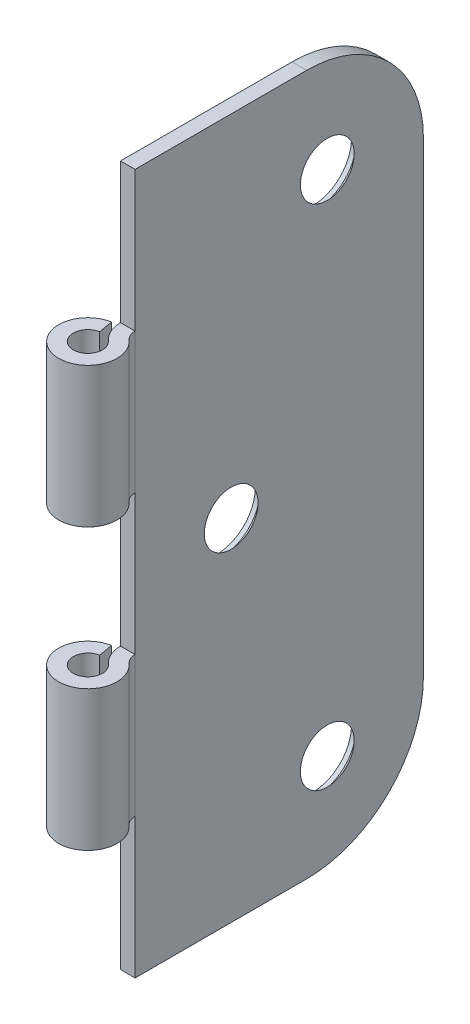
ISO-10303-21;
HEADER;
FILE_DESCRIPTION(('STEP AP214'),'2;1');
FILE_NAME('part.step','',(''),(''),'','','');
FILE_SCHEMA(('AUTOMOTIVE_DESIGN { 1 0 10303 214 1 1 1 1 }'));
ENDSEC;
DATA;
#1=APPLICATION_CONTEXT('core data for automotive mechanical design processes');
#2=APPLICATION_PROTOCOL_DEFINITION('international standard','automotive_design',2000,#1);
#3=PRODUCT_CONTEXT('',#1,'mechanical');
#4=PRODUCT('Part','Part','',(#3));
#5=PRODUCT_RELATED_PRODUCT_CATEGORY('part','',(#4));
#6=PRODUCT_DEFINITION_FORMATION('','',#4);
#7=PRODUCT_DEFINITION_CONTEXT('part definition',#1,'design');
#8=PRODUCT_DEFINITION('design','',#6,#7);
#9=PRODUCT_DEFINITION_SHAPE('','',#8);
#10=(LENGTH_UNIT() NAMED_UNIT(*) SI_UNIT(.MILLI.,.METRE.));
#11=(NAMED_UNIT(*) PLANE_ANGLE_UNIT() SI_UNIT($,.RADIAN.));
#12=(NAMED_UNIT(*) SI_UNIT($,.STERADIAN.) SOLID_ANGLE_UNIT());
#13=UNCERTAINTY_MEASURE_WITH_UNIT(LENGTH_MEASURE(1.E-05),#10,'distance_accuracy_value','');
#14=(GEOMETRIC_REPRESENTATION_CONTEXT(3) GLOBAL_UNCERTAINTY_ASSIGNED_CONTEXT((#13)) GLOBAL_UNIT_ASSIGNED_CONTEXT((#10,
#11,#12)) REPRESENTATION_CONTEXT('',''));
#15=CARTESIAN_POINT('',(0.,0.,0.));
#16=DIRECTION('',(0.,0.,1.));
#17=DIRECTION('',(1.,0.,0.));
#18=AXIS2_PLACEMENT_3D('',#15,#16,#17);
#19=CARTESIAN_POINT('',(0.,38.1,0.));
#20=DIRECTION('',(0.,-1.,0.));
#21=DIRECTION('',(0.,0.,-1.));
#22=AXIS2_PLACEMENT_3D('',#19,#20,#21);
#23=CYLINDRICAL_SURFACE('',#22,3.175);
#24=DIRECTION('',(0.,-1.,0.));
#25=VECTOR('',#24,1.);
#26=CARTESIAN_POINT('',(-0.551332964092483,38.1,-3.12676461581376));
#27=LINE('',#26,#25);
#28=CARTESIAN_POINT('',(-0.551332964092483,22.86,-3.12676461581376));
#29=VERTEX_POINT('',#28);
#30=CARTESIAN_POINT('',(-0.551332964092483,7.62000000000002,-3.12676461581376));
#31=VERTEX_POINT('',#30);
#32=EDGE_CURVE('E209',#29,#31,#27,.T.);
#33=ORIENTED_EDGE('',*,*,#32,.T.);
#34=CARTESIAN_POINT('',(0.,7.62000000000002,0.));
#35=DIRECTION('',(0.,1.,0.));
#36=DIRECTION('',(0.,0.,1.));
#37=AXIS2_PLACEMENT_3D('',#34,#35,#36);
#38=CIRCLE('',#37,3.175);
#39=CARTESIAN_POINT('',(2.11666666666667,7.62000000000002,-2.36650527618728));
#40=VERTEX_POINT('',#39);
#41=EDGE_CURVE('E327',#40,#31,#38,.F.);
#42=ORIENTED_EDGE('',*,*,#41,.F.);
#43=DIRECTION('',(0.,-1.,0.));
#44=VECTOR('',#43,1.);
#45=CARTESIAN_POINT('',(2.11666666666667,38.1,-2.36650527618728));
#46=LINE('',#45,#44);
#47=CARTESIAN_POINT('',(2.11666666666667,22.86,-2.36650527618728));
#48=VERTEX_POINT('',#47);
#49=EDGE_CURVE('E192',#48,#40,#46,.T.);
#50=ORIENTED_EDGE('',*,*,#49,.F.);
#51=CARTESIAN_POINT('',(0.,22.86,0.));
#52=DIRECTION('',(0.,-1.,0.));
#53=DIRECTION('',(0.,0.,-1.));
#54=AXIS2_PLACEMENT_3D('',#51,#52,#53);
#55=CIRCLE('',#54,3.175);
#56=EDGE_CURVE('E296',#29,#48,#55,.F.);
#57=ORIENTED_EDGE('',*,*,#56,.F.);
#58=EDGE_LOOP('',(#33,#42,#50,#57));
#59=FACE_BOUND('',#58,.T.);
#60=ADVANCED_FACE('F37',(#59),#23,.T.);
#61=CARTESIAN_POINT('',(3.175,38.1,-3.54975791428091));
#62=DIRECTION('',(0.,-1.,0.));
#63=DIRECTION('',(0.,0.,-1.));
#64=AXIS2_PLACEMENT_3D('',#61,#62,#63);
#65=CYLINDRICAL_SURFACE('',#64,3.175);
#66=DIRECTION('',(0.,-1.,0.));
#67=VECTOR('',#66,1.);
#68=CARTESIAN_POINT('',(0.,38.1,-3.54975791428091));
#69=LINE('',#68,#67);
#70=CARTESIAN_POINT('',(0.,22.86,-3.5497579142809));
#71=VERTEX_POINT('',#70);
#72=CARTESIAN_POINT('',(0.,7.62000000000003,-3.54975791428091));
#73=VERTEX_POINT('',#72);
#74=EDGE_CURVE('E279',#71,#73,#69,.T.);
#75=ORIENTED_EDGE('',*,*,#74,.T.);
#76=CARTESIAN_POINT('',(3.175,7.62000000000002,-3.54975791428091));
#77=DIRECTION('',(0.,1.,0.));
#78=DIRECTION('',(0.,0.,1.));
#79=AXIS2_PLACEMENT_3D('',#76,#77,#78);
#80=CIRCLE('',#79,3.175);
#81=CARTESIAN_POINT('',(1.05833333333333,7.62000000000002,-1.18325263809364));
#82=VERTEX_POINT('',#81);
#83=EDGE_CURVE('E182',#73,#82,#80,.T.);
#84=ORIENTED_EDGE('',*,*,#83,.T.);
#85=DIRECTION('',(0.,-1.,0.));
#86=VECTOR('',#85,1.);
#87=CARTESIAN_POINT('',(1.05833333333333,38.1,-1.18325263809364));
#88=LINE('',#87,#86);
#89=CARTESIAN_POINT('',(1.05833333333333,22.86,-1.18325263809364));
#90=VERTEX_POINT('',#89);
#91=EDGE_CURVE('E217',#90,#82,#88,.T.);
#92=ORIENTED_EDGE('',*,*,#91,.F.);
#93=CARTESIAN_POINT('',(3.175,22.86,-3.54975791428091));
#94=DIRECTION('',(0.,-1.,0.));
#95=DIRECTION('',(0.,0.,-1.));
#96=AXIS2_PLACEMENT_3D('',#93,#94,#95);
#97=CIRCLE('',#96,3.175);
#98=EDGE_CURVE('E284',#90,#71,#97,.T.);
#99=ORIENTED_EDGE('',*,*,#98,.T.);
#100=EDGE_LOOP('',(#75,#84,#92,#99));
#101=FACE_BOUND('',#100,.T.);
#102=ADVANCED_FACE('F381',(#101),#65,.T.);
#103=CARTESIAN_POINT('',(0.,38.1,0.));
#104=DIRECTION('',(0.,-1.,0.));
#105=DIRECTION('',(0.,0.,-1.));
#106=AXIS2_PLACEMENT_3D('',#103,#104,#105);
#107=CYLINDRICAL_SURFACE('',#106,1.5875);
#108=ORIENTED_EDGE('',*,*,#91,.T.);
#109=CARTESIAN_POINT('',(0.,7.62000000000002,0.));
#110=DIRECTION('',(0.,1.,0.));
#111=DIRECTION('',(0.,0.,1.));
#112=AXIS2_PLACEMENT_3D('',#109,#110,#111);
#113=CIRCLE('',#112,1.5875);
#114=CARTESIAN_POINT('',(-0.275666482046241,7.62000000000002,-1.56338230790688));
#115=VERTEX_POINT('',#114);
#116=EDGE_CURVE('E322',#82,#115,#113,.F.);
#117=ORIENTED_EDGE('',*,*,#116,.T.);
#118=DIRECTION('',(0.,-1.,0.));
#119=VECTOR('',#118,1.);
#120=CARTESIAN_POINT('',(-0.275666482046241,38.1,-1.56338230790688));
#121=LINE('',#120,#119);
#122=CARTESIAN_POINT('',(-0.275666482046241,22.86,-1.56338230790688));
#123=VERTEX_POINT('',#122);
#124=EDGE_CURVE('E213',#123,#115,#121,.T.);
#125=ORIENTED_EDGE('',*,*,#124,.F.);
#126=CARTESIAN_POINT('',(0.,22.86,0.));
#127=DIRECTION('',(0.,-1.,0.));
#128=DIRECTION('',(0.,0.,-1.));
#129=AXIS2_PLACEMENT_3D('',#126,#127,#128);
#130=CIRCLE('',#129,1.5875);
#131=EDGE_CURVE('E290',#123,#90,#130,.F.);
#132=ORIENTED_EDGE('',*,*,#131,.T.);
#133=EDGE_LOOP('',(#108,#117,#125,#132));
#134=FACE_BOUND('',#133,.T.);
#135=ADVANCED_FACE('F388',(#134),#107,.F.);
#136=CARTESIAN_POINT('',(0.,38.1,0.));
#137=DIRECTION('',(0.984807753012209,0.,-0.173648177666924));
#138=DIRECTION('',(-0.173648177666924,0.,-0.984807753012209));
#139=AXIS2_PLACEMENT_3D('',#136,#137,#138);
#140=PLANE('',#139);
#141=DIRECTION('',(0.173648177666924,0.,0.984807753012209));
#142=VECTOR('',#141,1.);
#143=CARTESIAN_POINT('',(0.,7.62000000000002,0.));
#144=LINE('',#143,#142);
#145=EDGE_CURVE('E325',#31,#115,#144,.T.);
#146=ORIENTED_EDGE('',*,*,#145,.F.);
#147=ORIENTED_EDGE('',*,*,#32,.F.);
#148=DIRECTION('',(-0.173648177666924,0.,-0.984807753012209));
#149=VECTOR('',#148,1.);
#150=CARTESIAN_POINT('',(0.,22.86,0.));
#151=LINE('',#150,#149);
#152=EDGE_CURVE('E293',#123,#29,#151,.T.);
#153=ORIENTED_EDGE('',*,*,#152,.F.);
#154=ORIENTED_EDGE('',*,*,#124,.T.);
#155=EDGE_LOOP('',(#146,#147,#153,#154));
#156=FACE_BOUND('',#155,.T.);
#157=ADVANCED_FACE('F402',(#156),#140,.T.);
#158=CARTESIAN_POINT('',(3.175,38.1,-3.54975791428091));
#159=DIRECTION('',(0.,-1.,0.));
#160=DIRECTION('',(0.,0.,-1.));
#161=AXIS2_PLACEMENT_3D('',#158,#159,#160);
#162=CYLINDRICAL_SURFACE('',#161,1.5875);
#163=CARTESIAN_POINT('',(3.175,7.62000000000002,-3.54975791428091));
#164=DIRECTION('',(0.,1.,0.));
#165=DIRECTION('',(0.,0.,1.));
#166=AXIS2_PLACEMENT_3D('',#163,#164,#165);
#167=CIRCLE('',#166,1.5875);
#168=CARTESIAN_POINT('',(1.5875,7.62000000000002,-3.54975791428091));
#169=VERTEX_POINT('',#168);
#170=EDGE_CURVE('E179',#169,#40,#167,.T.);
#171=ORIENTED_EDGE('',*,*,#170,.F.);
#172=DIRECTION('',(0.,-1.,0.));
#173=VECTOR('',#172,1.);
#174=CARTESIAN_POINT('',(1.5875,38.1,-3.54975791428091));
#175=LINE('',#174,#173);
#176=CARTESIAN_POINT('',(1.5875,22.86,-3.5497579142809));
#177=VERTEX_POINT('',#176);
#178=EDGE_CURVE('E189',#177,#169,#175,.T.);
#179=ORIENTED_EDGE('',*,*,#178,.F.);
#180=CARTESIAN_POINT('',(3.175,22.86,-3.54975791428091));
#181=DIRECTION('',(0.,-1.,0.));
#182=DIRECTION('',(0.,0.,-1.));
#183=AXIS2_PLACEMENT_3D('',#180,#181,#182);
#184=CIRCLE('',#183,1.5875);
#185=EDGE_CURVE('E223',#48,#177,#184,.T.);
#186=ORIENTED_EDGE('',*,*,#185,.F.);
#187=ORIENTED_EDGE('',*,*,#49,.T.);
#188=EDGE_LOOP('',(#171,#179,#186,#187));
#189=FACE_BOUND('',#188,.T.);
#190=ADVANCED_FACE('F187',(#189),#162,.F.);
#191=CARTESIAN_POINT('',(0.,-7.61999999999997,0.));
#192=DIRECTION('',(0.,-1.,0.));
#193=DIRECTION('',(0.,0.,-1.));
#194=AXIS2_PLACEMENT_3D('',#191,#192,#193);
#195=CIRCLE('',#194,3.175);
#196=CARTESIAN_POINT('',(-0.551332964092483,-7.61999999999997,-3.12676461581376));
#197=VERTEX_POINT('',#196);
#198=CARTESIAN_POINT('',(2.11666666666667,-7.61999999999997,-2.36650527618728));
#199=VERTEX_POINT('',#198);
#200=EDGE_CURVE('E173',#197,#199,#195,.F.);
#201=ORIENTED_EDGE('',*,*,#200,.F.);
#202=CARTESIAN_POINT('',(-0.551332964092483,-22.86,-3.12676461581376));
#203=VERTEX_POINT('',#202);
#204=EDGE_CURVE('E208',#197,#203,#27,.T.);
#205=ORIENTED_EDGE('',*,*,#204,.T.);
#206=CARTESIAN_POINT('',(0.,-22.86,0.));
#207=DIRECTION('',(0.,1.,0.));
#208=DIRECTION('',(0.,0.,1.));
#209=AXIS2_PLACEMENT_3D('',#206,#207,#208);
#210=CIRCLE('',#209,3.175);
#211=CARTESIAN_POINT('',(2.11666666666667,-22.86,-2.36650527618728));
#212=VERTEX_POINT('',#211);
#213=EDGE_CURVE('E310',#212,#203,#210,.F.);
#214=ORIENTED_EDGE('',*,*,#213,.F.);
#215=EDGE_CURVE('E202',#199,#212,#46,.T.);
#216=ORIENTED_EDGE('',*,*,#215,.F.);
#217=EDGE_LOOP('',(#201,#205,#214,#216));
#218=FACE_BOUND('',#217,.T.);
#219=ADVANCED_FACE('F384',(#218),#23,.T.);
#220=CARTESIAN_POINT('',(1.05833333333333,-7.61999999999997,-1.18325263809364));
#221=VERTEX_POINT('',#220);
#222=CARTESIAN_POINT('',(1.05833333333333,-22.86,-1.18325263809364));
#223=VERTEX_POINT('',#222);
#224=EDGE_CURVE('E216',#221,#223,#88,.T.);
#225=ORIENTED_EDGE('',*,*,#224,.F.);
#226=CARTESIAN_POINT('',(3.175,-7.61999999999997,-3.54975791428091));
#227=DIRECTION('',(0.,-1.,0.));
#228=DIRECTION('',(0.,0.,-1.));
#229=AXIS2_PLACEMENT_3D('',#226,#227,#228);
#230=CIRCLE('',#229,3.175);
#231=CARTESIAN_POINT('',(0.,-7.61999999999997,-3.54975791428091));
#232=VERTEX_POINT('',#231);
#233=EDGE_CURVE('E329',#221,#232,#230,.T.);
#234=ORIENTED_EDGE('',*,*,#233,.T.);
#235=CARTESIAN_POINT('',(0.,-22.86,-3.54975791428091));
#236=VERTEX_POINT('',#235);
#237=EDGE_CURVE('E281',#232,#236,#69,.T.);
#238=ORIENTED_EDGE('',*,*,#237,.T.);
#239=CARTESIAN_POINT('',(3.175,-22.86,-3.54975791428091));
#240=DIRECTION('',(0.,1.,0.));
#241=DIRECTION('',(0.,0.,1.));
#242=AXIS2_PLACEMENT_3D('',#239,#240,#241);
#243=CIRCLE('',#242,3.175);
#244=EDGE_CURVE('E301',#236,#223,#243,.T.);
#245=ORIENTED_EDGE('',*,*,#244,.T.);
#246=EDGE_LOOP('',(#225,#234,#238,#245));
#247=FACE_BOUND('',#246,.T.);
#248=ADVANCED_FACE('F391',(#247),#65,.T.);
#249=CARTESIAN_POINT('',(-0.275666482046241,-7.61999999999997,-1.56338230790688));
#250=VERTEX_POINT('',#249);
#251=CARTESIAN_POINT('',(-0.275666482046241,-22.86,-1.56338230790688));
#252=VERTEX_POINT('',#251);
#253=EDGE_CURVE('E212',#250,#252,#121,.T.);
#254=ORIENTED_EDGE('',*,*,#253,.F.);
#255=CARTESIAN_POINT('',(0.,-7.61999999999997,0.));
#256=DIRECTION('',(0.,-1.,0.));
#257=DIRECTION('',(0.,0.,-1.));
#258=AXIS2_PLACEMENT_3D('',#255,#256,#257);
#259=CIRCLE('',#258,1.5875);
#260=EDGE_CURVE('E332',#250,#221,#259,.F.);
#261=ORIENTED_EDGE('',*,*,#260,.T.);
#262=ORIENTED_EDGE('',*,*,#224,.T.);
#263=CARTESIAN_POINT('',(0.,-22.86,0.));
#264=DIRECTION('',(0.,1.,0.));
#265=DIRECTION('',(0.,0.,1.));
#266=AXIS2_PLACEMENT_3D('',#263,#264,#265);
#267=CIRCLE('',#266,1.5875);
#268=EDGE_CURVE('E304',#223,#252,#267,.F.);
#269=ORIENTED_EDGE('',*,*,#268,.T.);
#270=EDGE_LOOP('',(#254,#261,#262,#269));
#271=FACE_BOUND('',#270,.T.);
#272=ADVANCED_FACE('F400',(#271),#107,.F.);
#273=DIRECTION('',(-0.173648177666924,0.,-0.984807753012209));
#274=VECTOR('',#273,1.);
#275=CARTESIAN_POINT('',(0.,-7.61999999999997,0.));
#276=LINE('',#275,#274);
#277=EDGE_CURVE('E335',#250,#197,#276,.T.);
#278=ORIENTED_EDGE('',*,*,#277,.F.);
#279=ORIENTED_EDGE('',*,*,#253,.T.);
#280=DIRECTION('',(0.173648177666924,0.,0.984807753012209));
#281=VECTOR('',#280,1.);
#282=CARTESIAN_POINT('',(0.,-22.86,0.));
#283=LINE('',#282,#281);
#284=EDGE_CURVE('E307',#203,#252,#283,.T.);
#285=ORIENTED_EDGE('',*,*,#284,.F.);
#286=ORIENTED_EDGE('',*,*,#204,.F.);
#287=EDGE_LOOP('',(#278,#279,#285,#286));
#288=FACE_BOUND('',#287,.T.);
#289=ADVANCED_FACE('F414',(#288),#140,.T.);
#290=CARTESIAN_POINT('',(3.175,-7.61999999999997,-3.54975791428091));
#291=DIRECTION('',(0.,-1.,0.));
#292=DIRECTION('',(0.,0.,-1.));
#293=AXIS2_PLACEMENT_3D('',#290,#291,#292);
#294=CIRCLE('',#293,1.5875);
#295=CARTESIAN_POINT('',(1.5875,-7.61999999999997,-3.54975791428091));
#296=VERTEX_POINT('',#295);
#297=EDGE_CURVE('E194',#199,#296,#294,.T.);
#298=ORIENTED_EDGE('',*,*,#297,.F.);
#299=ORIENTED_EDGE('',*,*,#215,.T.);
#300=CARTESIAN_POINT('',(3.175,-22.86,-3.54975791428091));
#301=DIRECTION('',(0.,1.,0.));
#302=DIRECTION('',(0.,0.,1.));
#303=AXIS2_PLACEMENT_3D('',#300,#301,#302);
#304=CIRCLE('',#303,1.5875);
#305=CARTESIAN_POINT('',(1.5875,-22.86,-3.54975791428091));
#306=VERTEX_POINT('',#305);
#307=EDGE_CURVE('E228',#306,#212,#304,.T.);
#308=ORIENTED_EDGE('',*,*,#307,.F.);
#309=EDGE_CURVE('E200',#296,#306,#175,.T.);
#310=ORIENTED_EDGE('',*,*,#309,.F.);
#311=EDGE_LOOP('',(#298,#299,#308,#310));
#312=FACE_BOUND('',#311,.T.);
#313=ADVANCED_FACE('F403',(#312),#162,.F.);
#314=CARTESIAN_POINT('',(1.5875,38.1,0.));
#315=DIRECTION('',(1.,0.,0.));
#316=DIRECTION('',(0.,0.,-1.));
#317=AXIS2_PLACEMENT_3D('',#314,#315,#316);
#318=PLANE('',#317);
#319=CARTESIAN_POINT('',(1.5875,-27.641585971427,-24.466585971427));
#320=DIRECTION('',(1.,0.,0.));
#321=DIRECTION('',(0.,0.,-1.));
#322=AXIS2_PLACEMENT_3D('',#319,#320,#321);
#323=CIRCLE('',#322,2.92990199679455);
#324=CARTESIAN_POINT('',(1.5875,-27.641585971427,-27.3964879682215));
#325=VERTEX_POINT('',#324);
#326=EDGE_CURVE('E241',#325,#325,#323,.T.);
#327=ORIENTED_EDGE('',*,*,#326,.F.);
#328=EDGE_LOOP('',(#327));
#329=FACE_BOUND('',#328,.T.);
#330=CARTESIAN_POINT('',(1.5875,0.,-14.0081719428539));
#331=DIRECTION('',(1.,0.,0.));
#332=DIRECTION('',(0.,0.,-1.));
#333=AXIS2_PLACEMENT_3D('',#330,#331,#332);
#334=CIRCLE('',#333,2.92990199679455);
#335=CARTESIAN_POINT('',(1.5875,0.,-16.9380739396485));
#336=VERTEX_POINT('',#335);
#337=EDGE_CURVE('E236',#336,#336,#334,.T.);
#338=ORIENTED_EDGE('',*,*,#337,.F.);
#339=EDGE_LOOP('',(#338));
#340=FACE_BOUND('',#339,.T.);
#341=CARTESIAN_POINT('',(1.5875,27.641585971427,-24.466585971427));
#342=DIRECTION('',(1.,0.,0.));
#343=DIRECTION('',(0.,0.,-1.));
#344=AXIS2_PLACEMENT_3D('',#341,#342,#343);
#345=CIRCLE('',#344,2.92990199679455);
#346=CARTESIAN_POINT('',(1.5875,27.641585971427,-27.3964879682215));
#347=VERTEX_POINT('',#346);
#348=EDGE_CURVE('E232',#347,#347,#345,.T.);
#349=ORIENTED_EDGE('',*,*,#348,.F.);
#350=EDGE_LOOP('',(#349));
#351=FACE_BOUND('',#350,.T.);
#352=DIRECTION('',(0.,0.,1.));
#353=VECTOR('',#352,1.);
#354=CARTESIAN_POINT('',(1.5875,-38.1,0.));
#355=LINE('',#354,#353);
#356=CARTESIAN_POINT('',(1.5875,-38.1,-22.225));
#357=VERTEX_POINT('',#356);
#358=CARTESIAN_POINT('',(1.5875,-38.1,-3.54975791428091));
#359=VERTEX_POINT('',#358);
#360=EDGE_CURVE('E271',#357,#359,#355,.T.);
#361=ORIENTED_EDGE('',*,*,#360,.F.);
#362=CARTESIAN_POINT('',(1.5875,-25.4,-22.225));
#363=DIRECTION('',(1.,0.,0.));
#364=DIRECTION('',(0.,0.,-1.));
#365=AXIS2_PLACEMENT_3D('',#362,#363,#364);
#366=CIRCLE('',#365,12.7);
#367=CARTESIAN_POINT('',(1.5875,-25.4,-34.925));
#368=VERTEX_POINT('',#367);
#369=EDGE_CURVE('E250',#357,#368,#366,.T.);
#370=ORIENTED_EDGE('',*,*,#369,.T.);
#371=DIRECTION('',(0.,-1.,0.));
#372=VECTOR('',#371,1.);
#373=CARTESIAN_POINT('',(1.5875,38.1,-34.925));
#374=LINE('',#373,#372);
#375=CARTESIAN_POINT('',(1.5875,25.4,-34.925));
#376=VERTEX_POINT('',#375);
#377=EDGE_CURVE('E203',#376,#368,#374,.T.);
#378=ORIENTED_EDGE('',*,*,#377,.F.);
#379=CARTESIAN_POINT('',(1.5875,25.4,-22.225));
#380=DIRECTION('',(1.,0.,0.));
#381=DIRECTION('',(0.,0.,-1.));
#382=AXIS2_PLACEMENT_3D('',#379,#380,#381);
#383=CIRCLE('',#382,12.7);
#384=CARTESIAN_POINT('',(1.5875,38.1,-22.225));
#385=VERTEX_POINT('',#384);
#386=EDGE_CURVE('E248',#376,#385,#383,.T.);
#387=ORIENTED_EDGE('',*,*,#386,.T.);
#388=DIRECTION('',(0.,0.,1.));
#389=VECTOR('',#388,1.);
#390=CARTESIAN_POINT('',(1.5875,38.1,0.));
#391=LINE('',#390,#389);
#392=CARTESIAN_POINT('',(1.5875,38.1,-3.54975791428091));
#393=VERTEX_POINT('',#392);
#394=EDGE_CURVE('E270',#385,#393,#391,.T.);
#395=ORIENTED_EDGE('',*,*,#394,.T.);
#396=EDGE_CURVE('E199',#393,#177,#175,.T.);
#397=ORIENTED_EDGE('',*,*,#396,.T.);
#398=ORIENTED_EDGE('',*,*,#178,.T.);
#399=DIRECTION('',(0.,1.,0.));
#400=VECTOR('',#399,1.);
#401=CARTESIAN_POINT('',(1.5875,38.1,-3.5497579142809));
#402=LINE('',#401,#400);
#403=EDGE_CURVE('E163',#296,#169,#402,.T.);
#404=ORIENTED_EDGE('',*,*,#403,.F.);
#405=ORIENTED_EDGE('',*,*,#309,.T.);
#406=DIRECTION('',(0.,1.,0.));
#407=VECTOR('',#406,1.);
#408=CARTESIAN_POINT('',(1.5875,38.1,-3.5497579142809));
#409=LINE('',#408,#407);
#410=EDGE_CURVE('E313',#359,#306,#409,.T.);
#411=ORIENTED_EDGE('',*,*,#410,.F.);
#412=EDGE_LOOP('',(#361,#370,#378,#387,#395,#397,#398,#404,#405,#411));
#413=FACE_BOUND('',#412,.T.);
#414=ADVANCED_FACE('F197',(#329,#340,#351,#413),#318,.T.);
#415=CARTESIAN_POINT('',(0.,38.1,-34.925));
#416=DIRECTION('',(0.,0.,-1.));
#417=DIRECTION('',(-1.,0.,0.));
#418=AXIS2_PLACEMENT_3D('',#415,#416,#417);
#419=PLANE('',#418);
#420=ORIENTED_EDGE('',*,*,#377,.T.);
#421=DIRECTION('',(1.,0.,0.));
#422=VECTOR('',#421,1.);
#423=CARTESIAN_POINT('',(0.,-25.4,-34.925));
#424=LINE('',#423,#422);
#425=CARTESIAN_POINT('',(0.,-25.4,-34.925));
#426=VERTEX_POINT('',#425);
#427=EDGE_CURVE('E58',#368,#426,#424,.F.);
#428=ORIENTED_EDGE('',*,*,#427,.T.);
#429=DIRECTION('',(0.,-1.,0.));
#430=VECTOR('',#429,1.);
#431=CARTESIAN_POINT('',(0.,38.1,-34.925));
#432=LINE('',#431,#430);
#433=CARTESIAN_POINT('',(0.,25.4,-34.925));
#434=VERTEX_POINT('',#433);
#435=EDGE_CURVE('E264',#434,#426,#432,.T.);
#436=ORIENTED_EDGE('',*,*,#435,.F.);
#437=DIRECTION('',(1.,0.,0.));
#438=VECTOR('',#437,1.);
#439=CARTESIAN_POINT('',(0.,25.4,-34.925));
#440=LINE('',#439,#438);
#441=EDGE_CURVE('E252',#434,#376,#440,.T.);
#442=ORIENTED_EDGE('',*,*,#441,.T.);
#443=EDGE_LOOP('',(#420,#428,#436,#442));
#444=FACE_BOUND('',#443,.T.);
#445=ADVANCED_FACE('F276',(#444),#419,.T.);
#446=CARTESIAN_POINT('',(0.,38.1,0.));
#447=DIRECTION('',(1.,0.,0.));
#448=DIRECTION('',(0.,0.,-1.));
#449=AXIS2_PLACEMENT_3D('',#446,#447,#448);
#450=PLANE('',#449);
#451=CARTESIAN_POINT('',(0.,-27.641585971427,-24.466585971427));
#452=DIRECTION('',(-1.,0.,0.));
#453=DIRECTION('',(0.,0.,1.));
#454=AXIS2_PLACEMENT_3D('',#451,#452,#453);
#455=CIRCLE('',#454,4.2164);
#456=CARTESIAN_POINT('',(0.,-27.641585971427,-20.250185971427));
#457=VERTEX_POINT('',#456);
#458=EDGE_CURVE('E350',#457,#457,#455,.T.);
#459=ORIENTED_EDGE('',*,*,#458,.F.);
#460=EDGE_LOOP('',(#459));
#461=FACE_BOUND('',#460,.T.);
#462=CARTESIAN_POINT('',(0.,0.,-14.0081719428539));
#463=DIRECTION('',(-1.,0.,0.));
#464=DIRECTION('',(0.,0.,1.));
#465=AXIS2_PLACEMENT_3D('',#462,#463,#464);
#466=CIRCLE('',#465,4.2164);
#467=CARTESIAN_POINT('',(0.,0.,-9.79177194285394));
#468=VERTEX_POINT('',#467);
#469=EDGE_CURVE('E244',#468,#468,#466,.T.);
#470=ORIENTED_EDGE('',*,*,#469,.F.);
#471=EDGE_LOOP('',(#470));
#472=FACE_BOUND('',#471,.T.);
#473=CARTESIAN_POINT('',(0.,27.641585971427,-24.466585971427));
#474=DIRECTION('',(-1.,0.,0.));
#475=DIRECTION('',(0.,0.,1.));
#476=AXIS2_PLACEMENT_3D('',#473,#474,#475);
#477=CIRCLE('',#476,4.2164);
#478=CARTESIAN_POINT('',(0.,27.641585971427,-20.250185971427));
#479=VERTEX_POINT('',#478);
#480=EDGE_CURVE('E239',#479,#479,#477,.T.);
#481=ORIENTED_EDGE('',*,*,#480,.F.);
#482=EDGE_LOOP('',(#481));
#483=FACE_BOUND('',#482,.T.);
#484=ORIENTED_EDGE('',*,*,#435,.T.);
#485=CARTESIAN_POINT('',(0.,-25.4,-22.225));
#486=DIRECTION('',(1.,0.,0.));
#487=DIRECTION('',(0.,0.,-1.));
#488=AXIS2_PLACEMENT_3D('',#485,#486,#487);
#489=CIRCLE('',#488,12.7);
#490=CARTESIAN_POINT('',(0.,-38.1,-22.225));
#491=VERTEX_POINT('',#490);
#492=EDGE_CURVE('E45',#426,#491,#489,.F.);
#493=ORIENTED_EDGE('',*,*,#492,.T.);
#494=DIRECTION('',(0.,0.,1.));
#495=VECTOR('',#494,1.);
#496=CARTESIAN_POINT('',(0.,-38.1,0.));
#497=LINE('',#496,#495);
#498=CARTESIAN_POINT('',(0.,-38.1,-3.54975791428091));
#499=VERTEX_POINT('',#498);
#500=EDGE_CURVE('E262',#491,#499,#497,.T.);
#501=ORIENTED_EDGE('',*,*,#500,.T.);
#502=DIRECTION('',(0.,1.,0.));
#503=VECTOR('',#502,1.);
#504=CARTESIAN_POINT('',(0.,38.1,-3.5497579142809));
#505=LINE('',#504,#503);
#506=EDGE_CURVE('E316',#499,#236,#505,.T.);
#507=ORIENTED_EDGE('',*,*,#506,.T.);
#508=ORIENTED_EDGE('',*,*,#237,.F.);
#509=EDGE_CURVE('E427',#73,#232,#69,.T.);
#510=ORIENTED_EDGE('',*,*,#509,.F.);
#511=ORIENTED_EDGE('',*,*,#74,.F.);
#512=CARTESIAN_POINT('',(0.,38.1,-3.54975791428091));
#513=VERTEX_POINT('',#512);
#514=EDGE_CURVE('E278',#513,#71,#69,.T.);
#515=ORIENTED_EDGE('',*,*,#514,.F.);
#516=DIRECTION('',(0.,0.,1.));
#517=VECTOR('',#516,1.);
#518=CARTESIAN_POINT('',(0.,38.1,0.));
#519=LINE('',#518,#517);
#520=CARTESIAN_POINT('',(0.,38.1,-22.225));
#521=VERTEX_POINT('',#520);
#522=EDGE_CURVE('E285',#521,#513,#519,.T.);
#523=ORIENTED_EDGE('',*,*,#522,.F.);
#524=CARTESIAN_POINT('',(0.,25.4,-22.225));
#525=DIRECTION('',(1.,0.,0.));
#526=DIRECTION('',(0.,0.,-1.));
#527=AXIS2_PLACEMENT_3D('',#524,#525,#526);
#528=CIRCLE('',#527,12.7);
#529=EDGE_CURVE('E256',#521,#434,#528,.F.);
#530=ORIENTED_EDGE('',*,*,#529,.T.);
#531=EDGE_LOOP('',(#484,#493,#501,#507,#508,#510,#511,#515,#523,#530));
#532=FACE_BOUND('',#531,.T.);
#533=ADVANCED_FACE('F260',(#461,#472,#483,#532),#450,.F.);
#534=CARTESIAN_POINT('',(0.,38.1,0.));
#535=DIRECTION('',(0.,1.,0.));
#536=DIRECTION('',(0.,0.,1.));
#537=AXIS2_PLACEMENT_3D('',#534,#535,#536);
#538=PLANE('',#537);
#539=ORIENTED_EDGE('',*,*,#394,.F.);
#540=DIRECTION('',(1.,0.,0.));
#541=VECTOR('',#540,1.);
#542=CARTESIAN_POINT('',(0.,38.1,-22.225));
#543=LINE('',#542,#541);
#544=EDGE_CURVE('E11',#385,#521,#543,.F.);
#545=ORIENTED_EDGE('',*,*,#544,.T.);
#546=ORIENTED_EDGE('',*,*,#522,.T.);
#547=DIRECTION('',(-1.,0.,0.));
#548=VECTOR('',#547,1.);
#549=CARTESIAN_POINT('',(0.,38.1,-3.54975791428091));
#550=LINE('',#549,#548);
#551=EDGE_CURVE('E220',#393,#513,#550,.T.);
#552=ORIENTED_EDGE('',*,*,#551,.F.);
#553=EDGE_LOOP('',(#539,#545,#546,#552));
#554=FACE_BOUND('',#553,.T.);
#555=ADVANCED_FACE('F358',(#554),#538,.T.);
#556=CARTESIAN_POINT('',(0.,-38.1,0.));
#557=DIRECTION('',(0.,1.,0.));
#558=DIRECTION('',(0.,0.,1.));
#559=AXIS2_PLACEMENT_3D('',#556,#557,#558);
#560=PLANE('',#559);
#561=ORIENTED_EDGE('',*,*,#500,.F.);
#562=DIRECTION('',(1.,0.,0.));
#563=VECTOR('',#562,1.);
#564=CARTESIAN_POINT('',(1.5875,-38.1,-22.225));
#565=LINE('',#564,#563);
#566=EDGE_CURVE('E193',#491,#357,#565,.T.);
#567=ORIENTED_EDGE('',*,*,#566,.T.);
#568=ORIENTED_EDGE('',*,*,#360,.T.);
#569=DIRECTION('',(-1.,0.,0.));
#570=VECTOR('',#569,1.);
#571=CARTESIAN_POINT('',(0.,-38.1,-3.54975791428091));
#572=LINE('',#571,#570);
#573=EDGE_CURVE('E225',#359,#499,#572,.T.);
#574=ORIENTED_EDGE('',*,*,#573,.T.);
#575=EDGE_LOOP('',(#561,#567,#568,#574));
#576=FACE_BOUND('',#575,.T.);
#577=ADVANCED_FACE('F268',(#576),#560,.F.);
#578=CARTESIAN_POINT('',(-3.175,22.86,-3.5497579142809));
#579=DIRECTION('',(0.,-1.,0.));
#580=DIRECTION('',(0.,0.,-1.));
#581=AXIS2_PLACEMENT_3D('',#578,#579,#580);
#582=PLANE('',#581);
#583=ORIENTED_EDGE('',*,*,#131,.F.);
#584=ORIENTED_EDGE('',*,*,#152,.T.);
#585=ORIENTED_EDGE('',*,*,#56,.T.);
#586=ORIENTED_EDGE('',*,*,#185,.T.);
#587=DIRECTION('',(1.,0.,0.));
#588=VECTOR('',#587,1.);
#589=CARTESIAN_POINT('',(-3.175,22.86,-3.5497579142809));
#590=LINE('',#589,#588);
#591=EDGE_CURVE('E298',#71,#177,#590,.T.);
#592=ORIENTED_EDGE('',*,*,#591,.F.);
#593=ORIENTED_EDGE('',*,*,#98,.F.);
#594=EDGE_LOOP('',(#583,#584,#585,#586,#592,#593));
#595=FACE_BOUND('',#594,.T.);
#596=ADVANCED_FACE('F437',(#595),#582,.F.);
#597=CARTESIAN_POINT('',(-3.175,38.1,-3.54975791428091));
#598=DIRECTION('',(0.,0.,-1.));
#599=DIRECTION('',(0.,1.,0.));
#600=AXIS2_PLACEMENT_3D('',#597,#598,#599);
#601=PLANE('',#600);
#602=ORIENTED_EDGE('',*,*,#396,.F.);
#603=ORIENTED_EDGE('',*,*,#551,.T.);
#604=ORIENTED_EDGE('',*,*,#514,.T.);
#605=ORIENTED_EDGE('',*,*,#591,.T.);
#606=EDGE_LOOP('',(#602,#603,#604,#605));
#607=FACE_BOUND('',#606,.T.);
#608=ADVANCED_FACE('F434',(#607),#601,.F.);
#609=CARTESIAN_POINT('',(-3.175,-22.86,-3.54975791428091));
#610=DIRECTION('',(0.,1.,0.));
#611=DIRECTION('',(0.,0.,1.));
#612=AXIS2_PLACEMENT_3D('',#609,#610,#611);
#613=PLANE('',#612);
#614=DIRECTION('',(1.,0.,0.));
#615=VECTOR('',#614,1.);
#616=CARTESIAN_POINT('',(-3.175,-22.86,-3.54975791428091));
#617=LINE('',#616,#615);
#618=EDGE_CURVE('E318',#236,#306,#617,.T.);
#619=ORIENTED_EDGE('',*,*,#618,.T.);
#620=ORIENTED_EDGE('',*,*,#307,.T.);
#621=ORIENTED_EDGE('',*,*,#213,.T.);
#622=ORIENTED_EDGE('',*,*,#284,.T.);
#623=ORIENTED_EDGE('',*,*,#268,.F.);
#624=ORIENTED_EDGE('',*,*,#244,.F.);
#625=EDGE_LOOP('',(#619,#620,#621,#622,#623,#624));
#626=FACE_BOUND('',#625,.T.);
#627=ADVANCED_FACE('F417',(#626),#613,.F.);
#628=CARTESIAN_POINT('',(-3.175,-22.86,-3.54975791428091));
#629=DIRECTION('',(0.,0.,-1.));
#630=DIRECTION('',(0.,1.,0.));
#631=AXIS2_PLACEMENT_3D('',#628,#629,#630);
#632=PLANE('',#631);
#633=ORIENTED_EDGE('',*,*,#410,.T.);
#634=ORIENTED_EDGE('',*,*,#618,.F.);
#635=ORIENTED_EDGE('',*,*,#506,.F.);
#636=ORIENTED_EDGE('',*,*,#573,.F.);
#637=EDGE_LOOP('',(#633,#634,#635,#636));
#638=FACE_BOUND('',#637,.T.);
#639=ADVANCED_FACE('F425',(#638),#632,.F.);
#640=CARTESIAN_POINT('',(-3.175,7.62000000000002,-3.54975791428091));
#641=DIRECTION('',(0.,1.,0.));
#642=DIRECTION('',(0.,0.,1.));
#643=AXIS2_PLACEMENT_3D('',#640,#641,#642);
#644=PLANE('',#643);
#645=DIRECTION('',(1.,0.,0.));
#646=VECTOR('',#645,1.);
#647=CARTESIAN_POINT('',(-3.175,7.62000000000002,-3.54975791428091));
#648=LINE('',#647,#646);
#649=EDGE_CURVE('E166',#73,#169,#648,.T.);
#650=ORIENTED_EDGE('',*,*,#649,.T.);
#651=ORIENTED_EDGE('',*,*,#170,.T.);
#652=ORIENTED_EDGE('',*,*,#41,.T.);
#653=ORIENTED_EDGE('',*,*,#145,.T.);
#654=ORIENTED_EDGE('',*,*,#116,.F.);
#655=ORIENTED_EDGE('',*,*,#83,.F.);
#656=EDGE_LOOP('',(#650,#651,#652,#653,#654,#655));
#657=FACE_BOUND('',#656,.T.);
#658=ADVANCED_FACE('F178',(#657),#644,.F.);
#659=CARTESIAN_POINT('',(-3.175,-7.61999999999997,-3.54975791428091));
#660=DIRECTION('',(0.,-1.,0.));
#661=DIRECTION('',(0.,0.,-1.));
#662=AXIS2_PLACEMENT_3D('',#659,#660,#661);
#663=PLANE('',#662);
#664=ORIENTED_EDGE('',*,*,#260,.F.);
#665=ORIENTED_EDGE('',*,*,#277,.T.);
#666=ORIENTED_EDGE('',*,*,#200,.T.);
#667=ORIENTED_EDGE('',*,*,#297,.T.);
#668=DIRECTION('',(1.,0.,0.));
#669=VECTOR('',#668,1.);
#670=CARTESIAN_POINT('',(-3.175,-7.61999999999997,-3.54975791428091));
#671=LINE('',#670,#669);
#672=EDGE_CURVE('E169',#232,#296,#671,.T.);
#673=ORIENTED_EDGE('',*,*,#672,.F.);
#674=ORIENTED_EDGE('',*,*,#233,.F.);
#675=EDGE_LOOP('',(#664,#665,#666,#667,#673,#674));
#676=FACE_BOUND('',#675,.T.);
#677=ADVANCED_FACE('F410',(#676),#663,.F.);
#678=CARTESIAN_POINT('',(-3.175,7.62000000000002,-3.54975791428091));
#679=DIRECTION('',(0.,0.,-1.));
#680=DIRECTION('',(0.,1.,0.));
#681=AXIS2_PLACEMENT_3D('',#678,#679,#680);
#682=PLANE('',#681);
#683=ORIENTED_EDGE('',*,*,#403,.T.);
#684=ORIENTED_EDGE('',*,*,#649,.F.);
#685=ORIENTED_EDGE('',*,*,#509,.T.);
#686=ORIENTED_EDGE('',*,*,#672,.T.);
#687=EDGE_LOOP('',(#683,#684,#685,#686));
#688=FACE_BOUND('',#687,.T.);
#689=ADVANCED_FACE('F165',(#688),#682,.F.);
#690=CARTESIAN_POINT('',(0.507999999999998,27.641585971427,-24.466585971427));
#691=DIRECTION('',(-1.,0.,0.));
#692=DIRECTION('',(0.,0.,1.));
#693=AXIS2_PLACEMENT_3D('',#690,#691,#692);
#694=CONICAL_SURFACE('',#693,4.2164,0.872664625997165);
#695=ORIENTED_EDGE('',*,*,#348,.T.);
#696=EDGE_LOOP('',(#695));
#697=FACE_BOUND('',#696,.T.);
#698=CARTESIAN_POINT('',(0.507999999999998,27.641585971427,-24.466585971427));
#699=DIRECTION('',(-1.,0.,0.));
#700=DIRECTION('',(0.,0.,1.));
#701=AXIS2_PLACEMENT_3D('',#698,#699,#700);
#702=CIRCLE('',#701,4.2164);
#703=CARTESIAN_POINT('',(0.507999999999999,27.641585971427,-20.250185971427));
#704=VERTEX_POINT('',#703);
#705=EDGE_CURVE('E235',#704,#704,#702,.T.);
#706=ORIENTED_EDGE('',*,*,#705,.T.);
#707=EDGE_LOOP('',(#706));
#708=FACE_BOUND('',#707,.T.);
#709=ADVANCED_FACE('F367',(#697,#708),#694,.F.);
#710=CARTESIAN_POINT('',(0.,27.641585971427,-24.466585971427));
#711=DIRECTION('',(-1.,0.,0.));
#712=DIRECTION('',(0.,0.,1.));
#713=AXIS2_PLACEMENT_3D('',#710,#711,#712);
#714=CYLINDRICAL_SURFACE('',#713,4.2164);
#715=ORIENTED_EDGE('',*,*,#705,.F.);
#716=EDGE_LOOP('',(#715));
#717=FACE_BOUND('',#716,.T.);
#718=ORIENTED_EDGE('',*,*,#480,.T.);
#719=EDGE_LOOP('',(#718));
#720=FACE_BOUND('',#719,.T.);
#721=ADVANCED_FACE('F364',(#717,#720),#714,.F.);
#722=CARTESIAN_POINT('',(0.507999999999999,0.,-14.0081719428539));
#723=DIRECTION('',(-1.,0.,0.));
#724=DIRECTION('',(0.,0.,1.));
#725=AXIS2_PLACEMENT_3D('',#722,#723,#724);
#726=CONICAL_SURFACE('',#725,4.2164,0.872664625997165);
#727=ORIENTED_EDGE('',*,*,#337,.T.);
#728=EDGE_LOOP('',(#727));
#729=FACE_BOUND('',#728,.T.);
#730=CARTESIAN_POINT('',(0.507999999999999,0.,-14.0081719428539));
#731=DIRECTION('',(-1.,0.,0.));
#732=DIRECTION('',(0.,0.,1.));
#733=AXIS2_PLACEMENT_3D('',#730,#731,#732);
#734=CIRCLE('',#733,4.2164);
#735=CARTESIAN_POINT('',(0.507999999999999,0.,-9.79177194285394));
#736=VERTEX_POINT('',#735);
#737=EDGE_CURVE('E240',#736,#736,#734,.T.);
#738=ORIENTED_EDGE('',*,*,#737,.T.);
#739=EDGE_LOOP('',(#738));
#740=FACE_BOUND('',#739,.T.);
#741=ADVANCED_FACE('F366',(#729,#740),#726,.F.);
#742=CARTESIAN_POINT('',(0.,0.,-14.0081719428539));
#743=DIRECTION('',(-1.,0.,0.));
#744=DIRECTION('',(0.,0.,1.));
#745=AXIS2_PLACEMENT_3D('',#742,#743,#744);
#746=CYLINDRICAL_SURFACE('',#745,4.2164);
#747=ORIENTED_EDGE('',*,*,#737,.F.);
#748=EDGE_LOOP('',(#747));
#749=FACE_BOUND('',#748,.T.);
#750=ORIENTED_EDGE('',*,*,#469,.T.);
#751=EDGE_LOOP('',(#750));
#752=FACE_BOUND('',#751,.T.);
#753=ADVANCED_FACE('F374',(#749,#752),#746,.F.);
#754=CARTESIAN_POINT('',(0.507999999999998,-27.641585971427,-24.466585971427));
#755=DIRECTION('',(-1.,0.,0.));
#756=DIRECTION('',(0.,0.,1.));
#757=AXIS2_PLACEMENT_3D('',#754,#755,#756);
#758=CONICAL_SURFACE('',#757,4.2164,0.872664625997165);
#759=ORIENTED_EDGE('',*,*,#326,.T.);
#760=EDGE_LOOP('',(#759));
#761=FACE_BOUND('',#760,.T.);
#762=CARTESIAN_POINT('',(0.507999999999998,-27.641585971427,-24.466585971427));
#763=DIRECTION('',(-1.,0.,0.));
#764=DIRECTION('',(0.,0.,1.));
#765=AXIS2_PLACEMENT_3D('',#762,#763,#764);
#766=CIRCLE('',#765,4.2164);
#767=CARTESIAN_POINT('',(0.507999999999999,-27.641585971427,-20.250185971427));
#768=VERTEX_POINT('',#767);
#769=EDGE_CURVE('E245',#768,#768,#766,.T.);
#770=ORIENTED_EDGE('',*,*,#769,.T.);
#771=EDGE_LOOP('',(#770));
#772=FACE_BOUND('',#771,.T.);
#773=ADVANCED_FACE('F518',(#761,#772),#758,.F.);
#774=CARTESIAN_POINT('',(0.,-27.641585971427,-24.466585971427));
#775=DIRECTION('',(-1.,0.,0.));
#776=DIRECTION('',(0.,0.,1.));
#777=AXIS2_PLACEMENT_3D('',#774,#775,#776);
#778=CYLINDRICAL_SURFACE('',#777,4.2164);
#779=ORIENTED_EDGE('',*,*,#769,.F.);
#780=EDGE_LOOP('',(#779));
#781=FACE_BOUND('',#780,.T.);
#782=ORIENTED_EDGE('',*,*,#458,.T.);
#783=EDGE_LOOP('',(#782));
#784=FACE_BOUND('',#783,.T.);
#785=ADVANCED_FACE('F354',(#781,#784),#778,.F.);
#786=CARTESIAN_POINT('',(0.,-25.4,-22.225));
#787=DIRECTION('',(-1.,0.,0.));
#788=DIRECTION('',(0.,0.,1.));
#789=AXIS2_PLACEMENT_3D('',#786,#787,#788);
#790=CYLINDRICAL_SURFACE('',#789,12.7);
#791=ORIENTED_EDGE('',*,*,#492,.F.);
#792=ORIENTED_EDGE('',*,*,#427,.F.);
#793=ORIENTED_EDGE('',*,*,#369,.F.);
#794=ORIENTED_EDGE('',*,*,#566,.F.);
#795=EDGE_LOOP('',(#791,#792,#793,#794));
#796=FACE_BOUND('',#795,.T.);
#797=ADVANCED_FACE('F273',(#796),#790,.T.);
#798=CARTESIAN_POINT('',(0.,25.4,-22.225));
#799=DIRECTION('',(1.,0.,0.));
#800=DIRECTION('',(0.,0.,-1.));
#801=AXIS2_PLACEMENT_3D('',#798,#799,#800);
#802=CYLINDRICAL_SURFACE('',#801,12.7);
#803=ORIENTED_EDGE('',*,*,#529,.F.);
#804=ORIENTED_EDGE('',*,*,#544,.F.);
#805=ORIENTED_EDGE('',*,*,#386,.F.);
#806=ORIENTED_EDGE('',*,*,#441,.F.);
#807=EDGE_LOOP('',(#803,#804,#805,#806));
#808=FACE_BOUND('',#807,.T.);
#809=ADVANCED_FACE('F39',(#808),#802,.T.);
#810=CLOSED_SHELL('',(#60,#102,#135,#157,#190,#219,#248,#272,#289,#313,#414,#445,#533,#555,#577,
#596,#608,#627,#639,#658,#677,#689,#709,#721,#741,#753,#773,#785,#797,#809));
#811=MANIFOLD_SOLID_BREP('B2',#810);
#812=ADVANCED_BREP_SHAPE_REPRESENTATION('',(#18,#811),#14);
#813=SHAPE_DEFINITION_REPRESENTATION(#9,#812);
ENDSEC;
END-ISO-10303-21;
